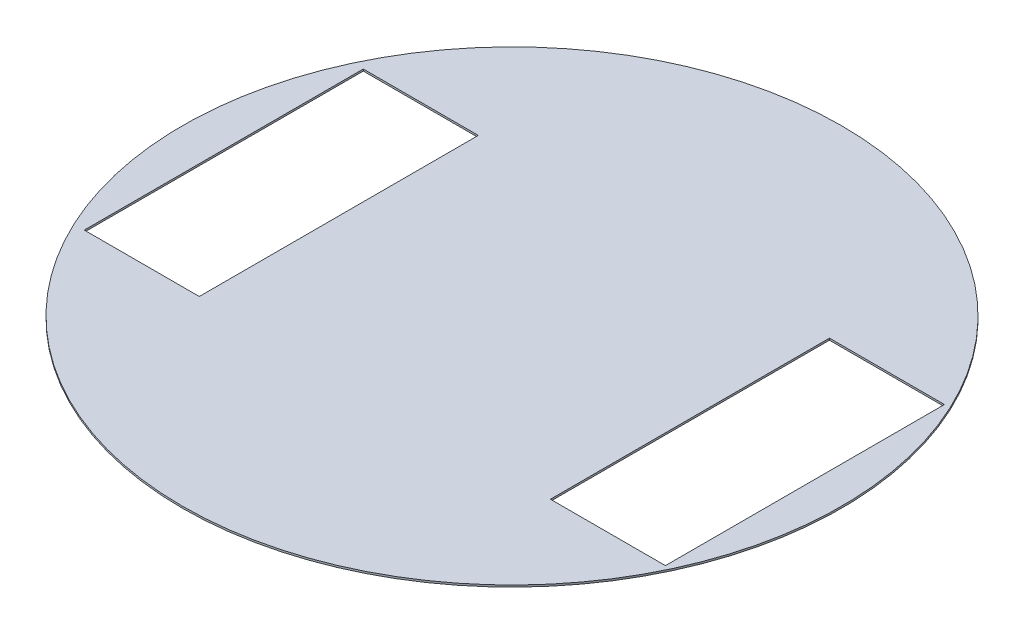
ISO-10303-21;
HEADER;
FILE_DESCRIPTION(('STEP AP214'),'2;1');
FILE_NAME('part.step','',(''),(''),'','','');
FILE_SCHEMA(('AUTOMOTIVE_DESIGN { 1 0 10303 214 1 1 1 1 }'));
ENDSEC;
DATA;
#1=APPLICATION_CONTEXT('core data for automotive mechanical design processes');
#2=APPLICATION_PROTOCOL_DEFINITION('international standard','automotive_design',2000,#1);
#3=PRODUCT_CONTEXT('',#1,'mechanical');
#4=PRODUCT('Part','Part','',(#3));
#5=PRODUCT_RELATED_PRODUCT_CATEGORY('part','',(#4));
#6=PRODUCT_DEFINITION_FORMATION('','',#4);
#7=PRODUCT_DEFINITION_CONTEXT('part definition',#1,'design');
#8=PRODUCT_DEFINITION('design','',#6,#7);
#9=PRODUCT_DEFINITION_SHAPE('','',#8);
#10=(LENGTH_UNIT() NAMED_UNIT(*) SI_UNIT(.MILLI.,.METRE.));
#11=(NAMED_UNIT(*) PLANE_ANGLE_UNIT() SI_UNIT($,.RADIAN.));
#12=(NAMED_UNIT(*) SI_UNIT($,.STERADIAN.) SOLID_ANGLE_UNIT());
#13=UNCERTAINTY_MEASURE_WITH_UNIT(LENGTH_MEASURE(1.E-05),#10,'distance_accuracy_value','');
#14=(GEOMETRIC_REPRESENTATION_CONTEXT(3) GLOBAL_UNCERTAINTY_ASSIGNED_CONTEXT((#13)) GLOBAL_UNIT_ASSIGNED_CONTEXT((#10,
#11,#12)) REPRESENTATION_CONTEXT('',''));
#15=CARTESIAN_POINT('',(0.,0.,0.));
#16=DIRECTION('',(0.,0.,1.));
#17=DIRECTION('',(1.,0.,0.));
#18=AXIS2_PLACEMENT_3D('',#15,#16,#17);
#19=CARTESIAN_POINT('',(0.,0.5,0.));
#20=DIRECTION('',(0.,1.,0.));
#21=DIRECTION('',(0.,0.,1.));
#22=AXIS2_PLACEMENT_3D('',#19,#20,#21);
#23=PLANE('',#22);
#24=CARTESIAN_POINT('',(0.,0.5,0.));
#25=DIRECTION('',(0.,1.,0.));
#26=DIRECTION('',(0.,0.,1.));
#27=AXIS2_PLACEMENT_3D('',#24,#25,#26);
#28=CIRCLE('',#27,90.);
#29=CARTESIAN_POINT('',(0.,0.5,90.));
#30=VERTEX_POINT('',#29);
#31=EDGE_CURVE('E151',#30,#30,#28,.T.);
#32=ORIENTED_EDGE('',*,*,#31,.T.);
#33=EDGE_LOOP('',(#32));
#34=FACE_BOUND('',#33,.T.);
#35=DIRECTION('',(1.,0.,0.));
#36=VECTOR('',#35,1.);
#37=CARTESIAN_POINT('',(0.,0.5,-38.1));
#38=LINE('',#37,#36);
#39=CARTESIAN_POINT('',(-78.7096520697039,0.5,-38.1));
#40=VERTEX_POINT('',#39);
#41=CARTESIAN_POINT('',(-47.301043169704,0.5,-38.1));
#42=VERTEX_POINT('',#41);
#43=EDGE_CURVE('E134',#40,#42,#38,.T.);
#44=ORIENTED_EDGE('',*,*,#43,.T.);
#45=DIRECTION('',(0.,0.,1.));
#46=VECTOR('',#45,1.);
#47=CARTESIAN_POINT('',(-47.301043169704,0.5,0.));
#48=LINE('',#47,#46);
#49=CARTESIAN_POINT('',(-47.301043169704,0.5,38.1));
#50=VERTEX_POINT('',#49);
#51=EDGE_CURVE('E60',#42,#50,#48,.T.);
#52=ORIENTED_EDGE('',*,*,#51,.T.);
#53=DIRECTION('',(1.,0.,0.));
#54=VECTOR('',#53,1.);
#55=CARTESIAN_POINT('',(0.,0.5,38.1));
#56=LINE('',#55,#54);
#57=CARTESIAN_POINT('',(-78.7096520697039,0.5,38.1));
#58=VERTEX_POINT('',#57);
#59=EDGE_CURVE('E140',#58,#50,#56,.T.);
#60=ORIENTED_EDGE('',*,*,#59,.F.);
#61=DIRECTION('',(0.,0.,1.));
#62=VECTOR('',#61,1.);
#63=CARTESIAN_POINT('',(-78.7096520697039,0.5,0.));
#64=LINE('',#63,#62);
#65=EDGE_CURVE('E137',#40,#58,#64,.T.);
#66=ORIENTED_EDGE('',*,*,#65,.F.);
#67=EDGE_LOOP('',(#44,#52,#60,#66));
#68=FACE_BOUND('',#67,.T.);
#69=DIRECTION('',(0.,0.,-1.));
#70=VECTOR('',#69,1.);
#71=CARTESIAN_POINT('',(48.5913911,0.5,0.));
#72=LINE('',#71,#70);
#73=CARTESIAN_POINT('',(48.5913911,0.5,38.1));
#74=VERTEX_POINT('',#73);
#75=CARTESIAN_POINT('',(48.5913911,0.5,-38.1));
#76=VERTEX_POINT('',#75);
#77=EDGE_CURVE('E118',#74,#76,#72,.T.);
#78=ORIENTED_EDGE('',*,*,#77,.T.);
#79=DIRECTION('',(1.,0.,0.));
#80=VECTOR('',#79,1.);
#81=CARTESIAN_POINT('',(0.,0.5,-38.1));
#82=LINE('',#81,#80);
#83=CARTESIAN_POINT('',(80.,0.5,-38.1));
#84=VERTEX_POINT('',#83);
#85=EDGE_CURVE('E52',#76,#84,#82,.T.);
#86=ORIENTED_EDGE('',*,*,#85,.T.);
#87=DIRECTION('',(0.,0.,1.));
#88=VECTOR('',#87,1.);
#89=CARTESIAN_POINT('',(80.,0.5,0.));
#90=LINE('',#89,#88);
#91=CARTESIAN_POINT('',(80.,0.5,38.1));
#92=VERTEX_POINT('',#91);
#93=EDGE_CURVE('E123',#84,#92,#90,.T.);
#94=ORIENTED_EDGE('',*,*,#93,.T.);
#95=DIRECTION('',(-1.,0.,0.));
#96=VECTOR('',#95,1.);
#97=CARTESIAN_POINT('',(0.,0.5,38.1));
#98=LINE('',#97,#96);
#99=EDGE_CURVE('E108',#92,#74,#98,.T.);
#100=ORIENTED_EDGE('',*,*,#99,.T.);
#101=EDGE_LOOP('',(#78,#86,#94,#100));
#102=FACE_BOUND('',#101,.T.);
#103=ADVANCED_FACE('F37',(#34,#68,#102),#23,.T.);
#104=CARTESIAN_POINT('',(0.,0.,0.));
#105=DIRECTION('',(0.,1.,0.));
#106=DIRECTION('',(0.,0.,1.));
#107=AXIS2_PLACEMENT_3D('',#104,#105,#106);
#108=PLANE('',#107);
#109=DIRECTION('',(0.,0.,1.));
#110=VECTOR('',#109,1.);
#111=CARTESIAN_POINT('',(-47.301043169704,0.,0.));
#112=LINE('',#111,#110);
#113=CARTESIAN_POINT('',(-47.301043169704,0.,-38.1));
#114=VERTEX_POINT('',#113);
#115=CARTESIAN_POINT('',(-47.301043169704,0.,38.1));
#116=VERTEX_POINT('',#115);
#117=EDGE_CURVE('E164',#114,#116,#112,.T.);
#118=ORIENTED_EDGE('',*,*,#117,.F.);
#119=DIRECTION('',(1.,0.,0.));
#120=VECTOR('',#119,1.);
#121=CARTESIAN_POINT('',(0.,0.,-38.1));
#122=LINE('',#121,#120);
#123=CARTESIAN_POINT('',(-78.7096520697039,0.,-38.1));
#124=VERTEX_POINT('',#123);
#125=EDGE_CURVE('E154',#124,#114,#122,.T.);
#126=ORIENTED_EDGE('',*,*,#125,.F.);
#127=DIRECTION('',(0.,0.,1.));
#128=VECTOR('',#127,1.);
#129=CARTESIAN_POINT('',(-78.7096520697039,0.,0.));
#130=LINE('',#129,#128);
#131=CARTESIAN_POINT('',(-78.7096520697039,0.,38.1));
#132=VERTEX_POINT('',#131);
#133=EDGE_CURVE('E158',#124,#132,#130,.T.);
#134=ORIENTED_EDGE('',*,*,#133,.T.);
#135=DIRECTION('',(1.,0.,0.));
#136=VECTOR('',#135,1.);
#137=CARTESIAN_POINT('',(0.,0.,38.1));
#138=LINE('',#137,#136);
#139=EDGE_CURVE('E161',#132,#116,#138,.T.);
#140=ORIENTED_EDGE('',*,*,#139,.T.);
#141=EDGE_LOOP('',(#118,#126,#134,#140));
#142=FACE_BOUND('',#141,.T.);
#143=CARTESIAN_POINT('',(0.,0.,0.));
#144=DIRECTION('',(0.,1.,0.));
#145=DIRECTION('',(0.,0.,1.));
#146=AXIS2_PLACEMENT_3D('',#143,#144,#145);
#147=CIRCLE('',#146,90.);
#148=CARTESIAN_POINT('',(0.,0.,90.));
#149=VERTEX_POINT('',#148);
#150=EDGE_CURVE('E130',#149,#149,#147,.T.);
#151=ORIENTED_EDGE('',*,*,#150,.F.);
#152=EDGE_LOOP('',(#151));
#153=FACE_BOUND('',#152,.T.);
#154=DIRECTION('',(1.,0.,0.));
#155=VECTOR('',#154,1.);
#156=CARTESIAN_POINT('',(0.,0.,-38.1));
#157=LINE('',#156,#155);
#158=CARTESIAN_POINT('',(48.5913911,0.,-38.1));
#159=VERTEX_POINT('',#158);
#160=CARTESIAN_POINT('',(80.,0.,-38.1));
#161=VERTEX_POINT('',#160);
#162=EDGE_CURVE('E11',#159,#161,#157,.T.);
#163=ORIENTED_EDGE('',*,*,#162,.F.);
#164=DIRECTION('',(0.,0.,-1.));
#165=VECTOR('',#164,1.);
#166=CARTESIAN_POINT('',(48.5913911,0.,0.));
#167=LINE('',#166,#165);
#168=CARTESIAN_POINT('',(48.5913911,0.,38.1));
#169=VERTEX_POINT('',#168);
#170=EDGE_CURVE('E166',#169,#159,#167,.T.);
#171=ORIENTED_EDGE('',*,*,#170,.F.);
#172=DIRECTION('',(-1.,0.,0.));
#173=VECTOR('',#172,1.);
#174=CARTESIAN_POINT('',(0.,0.,38.1));
#175=LINE('',#174,#173);
#176=CARTESIAN_POINT('',(80.,0.,38.1));
#177=VERTEX_POINT('',#176);
#178=EDGE_CURVE('E111',#177,#169,#175,.T.);
#179=ORIENTED_EDGE('',*,*,#178,.F.);
#180=DIRECTION('',(0.,0.,1.));
#181=VECTOR('',#180,1.);
#182=CARTESIAN_POINT('',(80.,0.,0.));
#183=LINE('',#182,#181);
#184=EDGE_CURVE('E45',#161,#177,#183,.T.);
#185=ORIENTED_EDGE('',*,*,#184,.F.);
#186=EDGE_LOOP('',(#163,#171,#179,#185));
#187=FACE_BOUND('',#186,.T.);
#188=ADVANCED_FACE('F174',(#142,#153,#187),#108,.F.);
#189=CARTESIAN_POINT('',(0.,0.5,0.));
#190=DIRECTION('',(0.,-1.,0.));
#191=DIRECTION('',(0.,0.,-1.));
#192=AXIS2_PLACEMENT_3D('',#189,#190,#191);
#193=CYLINDRICAL_SURFACE('',#192,90.);
#194=ORIENTED_EDGE('',*,*,#31,.F.);
#195=EDGE_LOOP('',(#194));
#196=FACE_BOUND('',#195,.T.);
#197=ORIENTED_EDGE('',*,*,#150,.T.);
#198=EDGE_LOOP('',(#197));
#199=FACE_BOUND('',#198,.T.);
#200=ADVANCED_FACE('F39',(#196,#199),#193,.T.);
#201=CARTESIAN_POINT('',(-47.301043169704,-0.5,0.));
#202=DIRECTION('',(-1.,0.,0.));
#203=DIRECTION('',(0.,0.,1.));
#204=AXIS2_PLACEMENT_3D('',#201,#202,#203);
#205=PLANE('',#204);
#206=ORIENTED_EDGE('',*,*,#117,.T.);
#207=DIRECTION('',(0.,1.,0.));
#208=VECTOR('',#207,1.);
#209=CARTESIAN_POINT('',(-47.301043169704,-0.5,38.1));
#210=LINE('',#209,#208);
#211=EDGE_CURVE('E144',#116,#50,#210,.T.);
#212=ORIENTED_EDGE('',*,*,#211,.T.);
#213=ORIENTED_EDGE('',*,*,#51,.F.);
#214=DIRECTION('',(0.,1.,0.));
#215=VECTOR('',#214,1.);
#216=CARTESIAN_POINT('',(-47.301043169704,-0.5,-38.1));
#217=LINE('',#216,#215);
#218=EDGE_CURVE('E143',#114,#42,#217,.T.);
#219=ORIENTED_EDGE('',*,*,#218,.F.);
#220=EDGE_LOOP('',(#206,#212,#213,#219));
#221=FACE_BOUND('',#220,.T.);
#222=ADVANCED_FACE('F198',(#221),#205,.T.);
#223=CARTESIAN_POINT('',(0.,-0.5,38.1));
#224=DIRECTION('',(0.,0.,1.));
#225=DIRECTION('',(1.,0.,0.));
#226=AXIS2_PLACEMENT_3D('',#223,#224,#225);
#227=PLANE('',#226);
#228=DIRECTION('',(0.,1.,0.));
#229=VECTOR('',#228,1.);
#230=CARTESIAN_POINT('',(-78.7096520697039,-0.5,38.1));
#231=LINE('',#230,#229);
#232=EDGE_CURVE('E146',#132,#58,#231,.T.);
#233=ORIENTED_EDGE('',*,*,#232,.T.);
#234=ORIENTED_EDGE('',*,*,#59,.T.);
#235=ORIENTED_EDGE('',*,*,#211,.F.);
#236=ORIENTED_EDGE('',*,*,#139,.F.);
#237=EDGE_LOOP('',(#233,#234,#235,#236));
#238=FACE_BOUND('',#237,.T.);
#239=ADVANCED_FACE('F200',(#238),#227,.F.);
#240=CARTESIAN_POINT('',(-78.7096520697039,-0.5,0.));
#241=DIRECTION('',(-1.,0.,0.));
#242=DIRECTION('',(0.,0.,1.));
#243=AXIS2_PLACEMENT_3D('',#240,#241,#242);
#244=PLANE('',#243);
#245=DIRECTION('',(0.,1.,0.));
#246=VECTOR('',#245,1.);
#247=CARTESIAN_POINT('',(-78.7096520697039,-0.5,-38.1));
#248=LINE('',#247,#246);
#249=EDGE_CURVE('E148',#124,#40,#248,.T.);
#250=ORIENTED_EDGE('',*,*,#249,.T.);
#251=ORIENTED_EDGE('',*,*,#65,.T.);
#252=ORIENTED_EDGE('',*,*,#232,.F.);
#253=ORIENTED_EDGE('',*,*,#133,.F.);
#254=EDGE_LOOP('',(#250,#251,#252,#253));
#255=FACE_BOUND('',#254,.T.);
#256=ADVANCED_FACE('F184',(#255),#244,.F.);
#257=CARTESIAN_POINT('',(0.,-0.5,-38.1));
#258=DIRECTION('',(0.,0.,1.));
#259=DIRECTION('',(1.,0.,0.));
#260=AXIS2_PLACEMENT_3D('',#257,#258,#259);
#261=PLANE('',#260);
#262=ORIENTED_EDGE('',*,*,#125,.T.);
#263=ORIENTED_EDGE('',*,*,#218,.T.);
#264=ORIENTED_EDGE('',*,*,#43,.F.);
#265=ORIENTED_EDGE('',*,*,#249,.F.);
#266=EDGE_LOOP('',(#262,#263,#264,#265));
#267=FACE_BOUND('',#266,.T.);
#268=ADVANCED_FACE('F177',(#267),#261,.T.);
#269=CARTESIAN_POINT('',(0.,-0.5,-38.1));
#270=DIRECTION('',(0.,0.,1.));
#271=DIRECTION('',(1.,0.,0.));
#272=AXIS2_PLACEMENT_3D('',#269,#270,#271);
#273=PLANE('',#272);
#274=ORIENTED_EDGE('',*,*,#162,.T.);
#275=DIRECTION('',(0.,1.,0.));
#276=VECTOR('',#275,1.);
#277=CARTESIAN_POINT('',(80.,-0.5,-38.1));
#278=LINE('',#277,#276);
#279=EDGE_CURVE('E128',#161,#84,#278,.T.);
#280=ORIENTED_EDGE('',*,*,#279,.T.);
#281=ORIENTED_EDGE('',*,*,#85,.F.);
#282=DIRECTION('',(0.,1.,0.));
#283=VECTOR('',#282,1.);
#284=CARTESIAN_POINT('',(48.5913911,-0.5,-38.1));
#285=LINE('',#284,#283);
#286=EDGE_CURVE('E115',#159,#76,#285,.T.);
#287=ORIENTED_EDGE('',*,*,#286,.F.);
#288=EDGE_LOOP('',(#274,#280,#281,#287));
#289=FACE_BOUND('',#288,.T.);
#290=ADVANCED_FACE('F175',(#289),#273,.T.);
#291=CARTESIAN_POINT('',(80.,-0.5,0.));
#292=DIRECTION('',(-1.,0.,0.));
#293=DIRECTION('',(0.,0.,1.));
#294=AXIS2_PLACEMENT_3D('',#291,#292,#293);
#295=PLANE('',#294);
#296=ORIENTED_EDGE('',*,*,#184,.T.);
#297=DIRECTION('',(0.,1.,0.));
#298=VECTOR('',#297,1.);
#299=CARTESIAN_POINT('',(80.,-0.5,38.1));
#300=LINE('',#299,#298);
#301=EDGE_CURVE('E114',#177,#92,#300,.T.);
#302=ORIENTED_EDGE('',*,*,#301,.T.);
#303=ORIENTED_EDGE('',*,*,#93,.F.);
#304=ORIENTED_EDGE('',*,*,#279,.F.);
#305=EDGE_LOOP('',(#296,#302,#303,#304));
#306=FACE_BOUND('',#305,.T.);
#307=ADVANCED_FACE('F171',(#306),#295,.T.);
#308=CARTESIAN_POINT('',(0.,-0.5,38.1));
#309=DIRECTION('',(0.,0.,-1.));
#310=DIRECTION('',(-1.,0.,0.));
#311=AXIS2_PLACEMENT_3D('',#308,#309,#310);
#312=PLANE('',#311);
#313=ORIENTED_EDGE('',*,*,#178,.T.);
#314=DIRECTION('',(0.,1.,0.));
#315=VECTOR('',#314,1.);
#316=CARTESIAN_POINT('',(48.5913911,-0.5,38.1));
#317=LINE('',#316,#315);
#318=EDGE_CURVE('E103',#169,#74,#317,.T.);
#319=ORIENTED_EDGE('',*,*,#318,.T.);
#320=ORIENTED_EDGE('',*,*,#99,.F.);
#321=ORIENTED_EDGE('',*,*,#301,.F.);
#322=EDGE_LOOP('',(#313,#319,#320,#321));
#323=FACE_BOUND('',#322,.T.);
#324=ADVANCED_FACE('F105',(#323),#312,.T.);
#325=CARTESIAN_POINT('',(48.5913911,-0.5,0.));
#326=DIRECTION('',(1.,0.,0.));
#327=DIRECTION('',(0.,0.,-1.));
#328=AXIS2_PLACEMENT_3D('',#325,#326,#327);
#329=PLANE('',#328);
#330=ORIENTED_EDGE('',*,*,#170,.T.);
#331=ORIENTED_EDGE('',*,*,#286,.T.);
#332=ORIENTED_EDGE('',*,*,#77,.F.);
#333=ORIENTED_EDGE('',*,*,#318,.F.);
#334=EDGE_LOOP('',(#330,#331,#332,#333));
#335=FACE_BOUND('',#334,.T.);
#336=ADVANCED_FACE('F119',(#335),#329,.T.);
#337=CLOSED_SHELL('',(#103,#188,#200,#222,#239,#256,#268,#290,#307,#324,#336));
#338=MANIFOLD_SOLID_BREP('B2',#337);
#339=ADVANCED_BREP_SHAPE_REPRESENTATION('',(#18,#338),#14);
#340=SHAPE_DEFINITION_REPRESENTATION(#9,#339);
ENDSEC;
END-ISO-10303-21;
